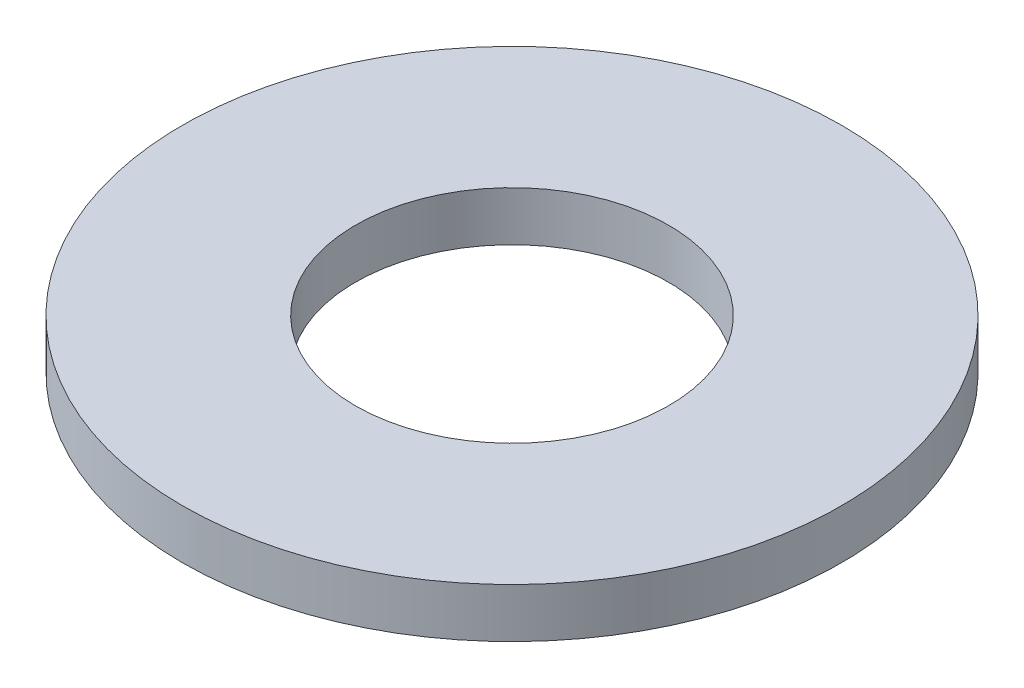
ISO-10303-21;
HEADER;
FILE_DESCRIPTION(('STEP AP214'),'2;1');
FILE_NAME('part.step','',(''),(''),'','','');
FILE_SCHEMA(('AUTOMOTIVE_DESIGN { 1 0 10303 214 1 1 1 1 }'));
ENDSEC;
DATA;
#1=APPLICATION_CONTEXT('core data for automotive mechanical design processes');
#2=APPLICATION_PROTOCOL_DEFINITION('international standard','automotive_design',2000,#1);
#3=PRODUCT_CONTEXT('',#1,'mechanical');
#4=PRODUCT('Part','Part','',(#3));
#5=PRODUCT_RELATED_PRODUCT_CATEGORY('part','',(#4));
#6=PRODUCT_DEFINITION_FORMATION('','',#4);
#7=PRODUCT_DEFINITION_CONTEXT('part definition',#1,'design');
#8=PRODUCT_DEFINITION('design','',#6,#7);
#9=PRODUCT_DEFINITION_SHAPE('','',#8);
#10=(LENGTH_UNIT() NAMED_UNIT(*) SI_UNIT(.MILLI.,.METRE.));
#11=(NAMED_UNIT(*) PLANE_ANGLE_UNIT() SI_UNIT($,.RADIAN.));
#12=(NAMED_UNIT(*) SI_UNIT($,.STERADIAN.) SOLID_ANGLE_UNIT());
#13=UNCERTAINTY_MEASURE_WITH_UNIT(LENGTH_MEASURE(1.E-05),#10,'distance_accuracy_value','');
#14=(GEOMETRIC_REPRESENTATION_CONTEXT(3) GLOBAL_UNCERTAINTY_ASSIGNED_CONTEXT((#13)) GLOBAL_UNIT_ASSIGNED_CONTEXT((#10,
#11,#12)) REPRESENTATION_CONTEXT('',''));
#15=CARTESIAN_POINT('',(0.,0.,0.));
#16=DIRECTION('',(0.,0.,1.));
#17=DIRECTION('',(1.,0.,0.));
#18=AXIS2_PLACEMENT_3D('',#15,#16,#17);
#19=CARTESIAN_POINT('',(0.,15.,0.));
#20=DIRECTION('',(0.,-1.,0.));
#21=DIRECTION('',(0.,0.,-1.));
#22=AXIS2_PLACEMENT_3D('',#19,#20,#21);
#23=CYLINDRICAL_SURFACE('',#22,100.);
#24=CARTESIAN_POINT('',(0.,15.,0.));
#25=DIRECTION('',(0.,1.,0.));
#26=DIRECTION('',(0.,0.,1.));
#27=AXIS2_PLACEMENT_3D('',#24,#25,#26);
#28=CIRCLE('',#27,100.);
#29=CARTESIAN_POINT('',(0.,15.,100.));
#30=VERTEX_POINT('',#29);
#31=EDGE_CURVE('E10',#30,#30,#28,.T.);
#32=ORIENTED_EDGE('',*,*,#31,.F.);
#33=EDGE_LOOP('',(#32));
#34=FACE_BOUND('',#33,.T.);
#35=CARTESIAN_POINT('',(0.,0.,0.));
#36=DIRECTION('',(0.,1.,0.));
#37=DIRECTION('',(0.,0.,1.));
#38=AXIS2_PLACEMENT_3D('',#35,#36,#37);
#39=CIRCLE('',#38,100.);
#40=CARTESIAN_POINT('',(0.,0.,100.));
#41=VERTEX_POINT('',#40);
#42=EDGE_CURVE('E37',#41,#41,#39,.T.);
#43=ORIENTED_EDGE('',*,*,#42,.T.);
#44=EDGE_LOOP('',(#43));
#45=FACE_BOUND('',#44,.T.);
#46=ADVANCED_FACE('F40',(#34,#45),#23,.T.);
#47=CARTESIAN_POINT('',(0.,15.,0.));
#48=DIRECTION('',(0.,1.,0.));
#49=DIRECTION('',(0.,0.,1.));
#50=AXIS2_PLACEMENT_3D('',#47,#48,#49);
#51=PLANE('',#50);
#52=CARTESIAN_POINT('',(0.,15.,0.));
#53=DIRECTION('',(0.,1.,0.));
#54=DIRECTION('',(0.,0.,1.));
#55=AXIS2_PLACEMENT_3D('',#52,#53,#54);
#56=CIRCLE('',#55,47.5);
#57=CARTESIAN_POINT('',(0.,15.,47.5));
#58=VERTEX_POINT('',#57);
#59=EDGE_CURVE('E50',#58,#58,#56,.T.);
#60=ORIENTED_EDGE('',*,*,#59,.F.);
#61=EDGE_LOOP('',(#60));
#62=FACE_BOUND('',#61,.T.);
#63=ORIENTED_EDGE('',*,*,#31,.T.);
#64=EDGE_LOOP('',(#63));
#65=FACE_BOUND('',#64,.T.);
#66=ADVANCED_FACE('F59',(#62,#65),#51,.T.);
#67=CARTESIAN_POINT('',(0.,0.,0.));
#68=DIRECTION('',(0.,1.,0.));
#69=DIRECTION('',(0.,0.,1.));
#70=AXIS2_PLACEMENT_3D('',#67,#68,#69);
#71=PLANE('',#70);
#72=CARTESIAN_POINT('',(0.,0.,0.));
#73=DIRECTION('',(0.,1.,0.));
#74=DIRECTION('',(0.,0.,1.));
#75=AXIS2_PLACEMENT_3D('',#72,#73,#74);
#76=CIRCLE('',#75,47.5);
#77=CARTESIAN_POINT('',(0.,0.,47.5));
#78=VERTEX_POINT('',#77);
#79=EDGE_CURVE('E47',#78,#78,#76,.T.);
#80=ORIENTED_EDGE('',*,*,#79,.T.);
#81=EDGE_LOOP('',(#80));
#82=FACE_BOUND('',#81,.T.);
#83=ORIENTED_EDGE('',*,*,#42,.F.);
#84=EDGE_LOOP('',(#83));
#85=FACE_BOUND('',#84,.T.);
#86=ADVANCED_FACE('F58',(#82,#85),#71,.F.);
#87=CARTESIAN_POINT('',(0.,15.,0.));
#88=DIRECTION('',(0.,-1.,0.));
#89=DIRECTION('',(0.,0.,-1.));
#90=AXIS2_PLACEMENT_3D('',#87,#88,#89);
#91=CYLINDRICAL_SURFACE('',#90,47.5);
#92=ORIENTED_EDGE('',*,*,#59,.T.);
#93=EDGE_LOOP('',(#92));
#94=FACE_BOUND('',#93,.T.);
#95=ORIENTED_EDGE('',*,*,#79,.F.);
#96=EDGE_LOOP('',(#95));
#97=FACE_BOUND('',#96,.T.);
#98=ADVANCED_FACE('F54',(#94,#97),#91,.F.);
#99=CLOSED_SHELL('',(#46,#66,#86,#98));
#100=MANIFOLD_SOLID_BREP('B2',#99);
#101=ADVANCED_BREP_SHAPE_REPRESENTATION('',(#18,#100),#14);
#102=SHAPE_DEFINITION_REPRESENTATION(#9,#101);
ENDSEC;
END-ISO-10303-21;
